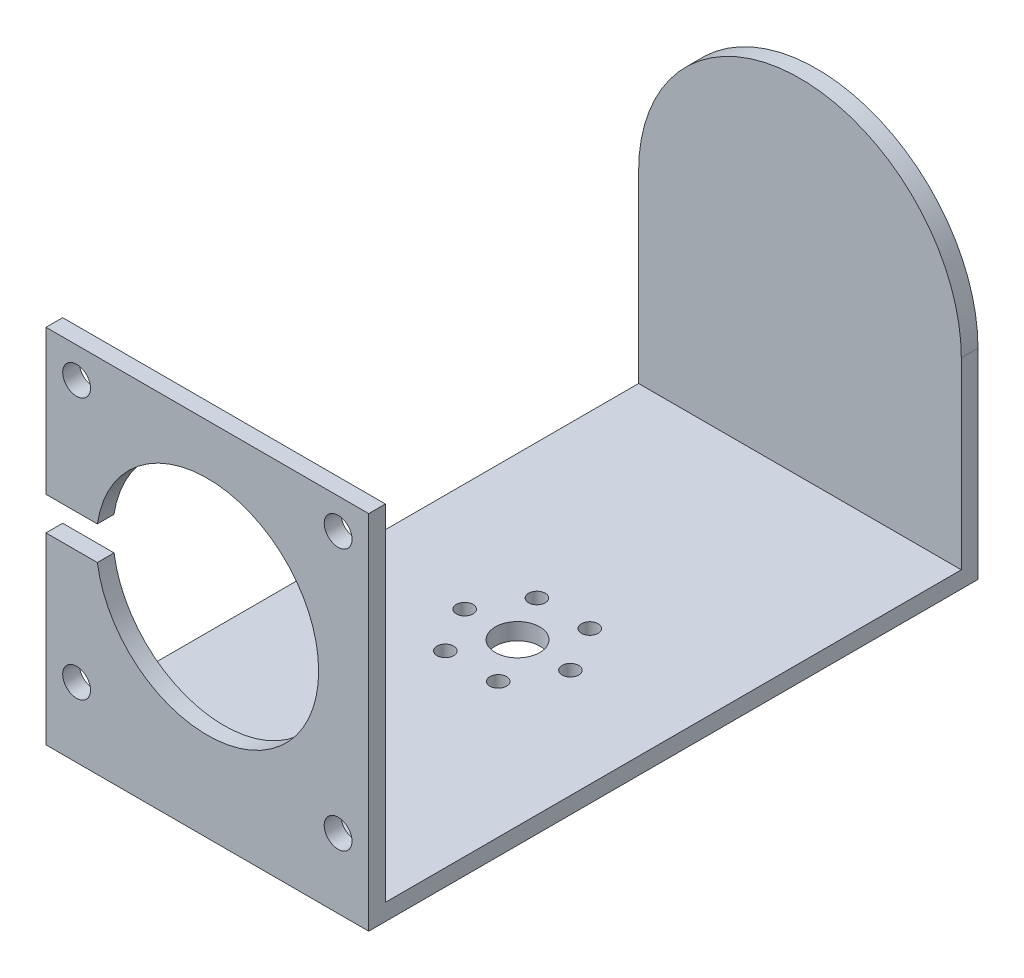
ISO-10303-21;
HEADER;
FILE_DESCRIPTION(('STEP AP214'),'2;1');
FILE_NAME('part.step','',(''),(''),'','','');
FILE_SCHEMA(('AUTOMOTIVE_DESIGN { 1 0 10303 214 1 1 1 1 }'));
ENDSEC;
DATA;
#1=APPLICATION_CONTEXT('core data for automotive mechanical design processes');
#2=APPLICATION_PROTOCOL_DEFINITION('international standard','automotive_design',2000,#1);
#3=PRODUCT_CONTEXT('',#1,'mechanical');
#4=PRODUCT('Part','Part','',(#3));
#5=PRODUCT_RELATED_PRODUCT_CATEGORY('part','',(#4));
#6=PRODUCT_DEFINITION_FORMATION('','',#4);
#7=PRODUCT_DEFINITION_CONTEXT('part definition',#1,'design');
#8=PRODUCT_DEFINITION('design','',#6,#7);
#9=PRODUCT_DEFINITION_SHAPE('','',#8);
#10=(LENGTH_UNIT() NAMED_UNIT(*) SI_UNIT(.MILLI.,.METRE.));
#11=(NAMED_UNIT(*) PLANE_ANGLE_UNIT() SI_UNIT($,.RADIAN.));
#12=(NAMED_UNIT(*) SI_UNIT($,.STERADIAN.) SOLID_ANGLE_UNIT());
#13=UNCERTAINTY_MEASURE_WITH_UNIT(LENGTH_MEASURE(1.E-05),#10,'distance_accuracy_value','');
#14=(GEOMETRIC_REPRESENTATION_CONTEXT(3) GLOBAL_UNCERTAINTY_ASSIGNED_CONTEXT((#13)) GLOBAL_UNIT_ASSIGNED_CONTEXT((#10,
#11,#12)) REPRESENTATION_CONTEXT('',''));
#15=CARTESIAN_POINT('',(0.,0.,0.));
#16=DIRECTION('',(0.,0.,1.));
#17=DIRECTION('',(1.,0.,0.));
#18=AXIS2_PLACEMENT_3D('',#15,#16,#17);
#19=CARTESIAN_POINT('',(0.,0.,0.));
#20=DIRECTION('',(-1.,0.,0.));
#21=DIRECTION('',(0.,0.,1.));
#22=AXIS2_PLACEMENT_3D('',#19,#20,#21);
#23=PLANE('',#22);
#24=DIRECTION('',(0.,0.,1.));
#25=VECTOR('',#24,1.);
#26=CARTESIAN_POINT('',(0.,-31.5991903846266,0.));
#27=LINE('',#26,#25);
#28=CARTESIAN_POINT('',(0.,-31.5991903846266,-30.1483281173427));
#29=VERTEX_POINT('',#28);
#30=CARTESIAN_POINT('',(0.,-31.5991903846266,73.3516718826573));
#31=VERTEX_POINT('',#30);
#32=EDGE_CURVE('E144',#29,#31,#27,.T.);
#33=ORIENTED_EDGE('',*,*,#32,.F.);
#34=DIRECTION('',(0.,-1.,0.));
#35=VECTOR('',#34,1.);
#36=CARTESIAN_POINT('',(0.,-29.5991903846266,-30.1483281173427));
#37=LINE('',#36,#35);
#38=CARTESIAN_POINT('',(0.,1.40080961537345,-30.1483281173427));
#39=VERTEX_POINT('',#38);
#40=EDGE_CURVE('E225',#39,#29,#37,.T.);
#41=ORIENTED_EDGE('',*,*,#40,.F.);
#42=DIRECTION('',(0.,0.,-1.));
#43=VECTOR('',#42,1.);
#44=CARTESIAN_POINT('',(0.,1.40080961537345,24.8516718826573));
#45=LINE('',#44,#43);
#46=CARTESIAN_POINT('',(0.,1.40080961537345,-33.1483281173427));
#47=VERTEX_POINT('',#46);
#48=EDGE_CURVE('E251',#47,#39,#45,.F.);
#49=ORIENTED_EDGE('',*,*,#48,.F.);
#50=DIRECTION('',(0.,1.,0.));
#51=VECTOR('',#50,1.);
#52=CARTESIAN_POINT('',(0.,30.4008096153734,-33.1483281173427));
#53=LINE('',#52,#51);
#54=CARTESIAN_POINT('',(0.,-34.5991903846266,-33.1483281173427));
#55=VERTEX_POINT('',#54);
#56=EDGE_CURVE('E222',#55,#47,#53,.T.);
#57=ORIENTED_EDGE('',*,*,#56,.F.);
#58=DIRECTION('',(0.,0.,-1.));
#59=VECTOR('',#58,1.);
#60=CARTESIAN_POINT('',(0.,-34.5991903846266,-33.1483281173427));
#61=LINE('',#60,#59);
#62=CARTESIAN_POINT('',(0.,-34.5991903846266,76.3516718826573));
#63=VERTEX_POINT('',#62);
#64=EDGE_CURVE('E220',#63,#55,#61,.T.);
#65=ORIENTED_EDGE('',*,*,#64,.F.);
#66=DIRECTION('',(0.,-1.,0.));
#67=VECTOR('',#66,1.);
#68=CARTESIAN_POINT('',(0.,-34.5991903846266,76.3516718826573));
#69=LINE('',#68,#67);
#70=CARTESIAN_POINT('',(0.,-1.59919038462657,76.3516718826573));
#71=VERTEX_POINT('',#70);
#72=EDGE_CURVE('E216',#71,#63,#69,.T.);
#73=ORIENTED_EDGE('',*,*,#72,.F.);
#74=DIRECTION('',(0.,0.,1.));
#75=VECTOR('',#74,1.);
#76=CARTESIAN_POINT('',(0.,-1.59919038462657,66.3516718826573));
#77=LINE('',#76,#75);
#78=CARTESIAN_POINT('',(0.,-1.59919038462657,73.3516718826573));
#79=VERTEX_POINT('',#78);
#80=EDGE_CURVE('E167',#79,#71,#77,.T.);
#81=ORIENTED_EDGE('',*,*,#80,.F.);
#82=DIRECTION('',(0.,1.,0.));
#83=VECTOR('',#82,1.);
#84=CARTESIAN_POINT('',(0.,30.4008096153734,73.3516718826573));
#85=LINE('',#84,#83);
#86=EDGE_CURVE('E205',#31,#79,#85,.T.);
#87=ORIENTED_EDGE('',*,*,#86,.F.);
#88=EDGE_LOOP('',(#33,#41,#49,#57,#65,#73,#81,#87));
#89=FACE_BOUND('',#88,.T.);
#90=ADVANCED_FACE('F33',(#89),#23,.T.);
#91=CARTESIAN_POINT('',(58.,30.4008096153734,-33.1483281173427));
#92=DIRECTION('',(0.,0.,1.));
#93=DIRECTION('',(0.,-1.,0.));
#94=AXIS2_PLACEMENT_3D('',#91,#92,#93);
#95=PLANE('',#94);
#96=ORIENTED_EDGE('',*,*,#56,.T.);
#97=CARTESIAN_POINT('',(29.,1.40080961537345,-33.1483281173427));
#98=DIRECTION('',(0.,0.,1.));
#99=DIRECTION('',(1.,0.,0.));
#100=AXIS2_PLACEMENT_3D('',#97,#98,#99);
#101=CIRCLE('',#100,29.);
#102=CARTESIAN_POINT('',(58.,1.40080961537345,-33.1483281173427));
#103=VERTEX_POINT('',#102);
#104=EDGE_CURVE('E178',#103,#47,#101,.T.);
#105=ORIENTED_EDGE('',*,*,#104,.F.);
#106=DIRECTION('',(0.,1.,0.));
#107=VECTOR('',#106,1.);
#108=CARTESIAN_POINT('',(58.,30.4008096153734,-33.1483281173427));
#109=LINE('',#108,#107);
#110=CARTESIAN_POINT('',(58.,-34.5991903846266,-33.1483281173427));
#111=VERTEX_POINT('',#110);
#112=EDGE_CURVE('E209',#111,#103,#109,.T.);
#113=ORIENTED_EDGE('',*,*,#112,.F.);
#114=DIRECTION('',(-1.,0.,0.));
#115=VECTOR('',#114,1.);
#116=CARTESIAN_POINT('',(58.,-34.5991903846266,-33.1483281173427));
#117=LINE('',#116,#115);
#118=EDGE_CURVE('E230',#111,#55,#117,.T.);
#119=ORIENTED_EDGE('',*,*,#118,.T.);
#120=EDGE_LOOP('',(#96,#105,#113,#119));
#121=FACE_BOUND('',#120,.T.);
#122=CARTESIAN_POINT('',(29.,1.40080961537345,-33.1483281173427));
#123=DIRECTION('',(0.,0.,1.));
#124=DIRECTION('',(0.,-1.,0.));
#125=AXIS2_PLACEMENT_3D('',#122,#123,#124);
#126=CIRCLE('',#125,2.95);
#127=CARTESIAN_POINT('',(29.,-1.54919038462655,-33.1483281173427));
#128=VERTEX_POINT('',#127);
#129=EDGE_CURVE('E254',#128,#128,#126,.F.);
#130=ORIENTED_EDGE('',*,*,#129,.F.);
#131=EDGE_LOOP('',(#130));
#132=FACE_BOUND('',#131,.T.);
#133=ADVANCED_FACE('F296',(#121,#132),#95,.F.);
#134=CARTESIAN_POINT('',(58.,30.4008096153734,76.3516718826573));
#135=DIRECTION('',(0.,-1.,0.));
#136=DIRECTION('',(0.,0.,-1.));
#137=AXIS2_PLACEMENT_3D('',#134,#135,#136);
#138=PLANE('',#137);
#139=DIRECTION('',(0.,0.,1.));
#140=VECTOR('',#139,1.);
#141=CARTESIAN_POINT('',(0.,30.4008096153734,76.3516718826573));
#142=LINE('',#141,#140);
#143=CARTESIAN_POINT('',(0.,30.4008096153734,73.3516718826573));
#144=VERTEX_POINT('',#143);
#145=CARTESIAN_POINT('',(0.,30.4008096153734,76.3516718826573));
#146=VERTEX_POINT('',#145);
#147=EDGE_CURVE('E213',#144,#146,#142,.T.);
#148=ORIENTED_EDGE('',*,*,#147,.T.);
#149=DIRECTION('',(-1.,0.,0.));
#150=VECTOR('',#149,1.);
#151=CARTESIAN_POINT('',(58.,30.4008096153734,76.3516718826573));
#152=LINE('',#151,#150);
#153=CARTESIAN_POINT('',(58.,30.4008096153734,76.3516718826573));
#154=VERTEX_POINT('',#153);
#155=EDGE_CURVE('E236',#154,#146,#152,.T.);
#156=ORIENTED_EDGE('',*,*,#155,.F.);
#157=DIRECTION('',(0.,0.,1.));
#158=VECTOR('',#157,1.);
#159=CARTESIAN_POINT('',(58.,30.4008096153734,76.3516718826573));
#160=LINE('',#159,#158);
#161=CARTESIAN_POINT('',(58.,30.4008096153734,73.3516718826573));
#162=VERTEX_POINT('',#161);
#163=EDGE_CURVE('E202',#162,#154,#160,.T.);
#164=ORIENTED_EDGE('',*,*,#163,.F.);
#165=DIRECTION('',(-1.,0.,0.));
#166=VECTOR('',#165,1.);
#167=CARTESIAN_POINT('',(58.,30.4008096153734,73.3516718826573));
#168=LINE('',#167,#166);
#169=EDGE_CURVE('E129',#162,#144,#168,.T.);
#170=ORIENTED_EDGE('',*,*,#169,.T.);
#171=EDGE_LOOP('',(#148,#156,#164,#170));
#172=FACE_BOUND('',#171,.T.);
#173=ADVANCED_FACE('F35',(#172),#138,.F.);
#174=CARTESIAN_POINT('',(58.,-34.5991903846266,76.3516718826573));
#175=DIRECTION('',(0.,0.,-1.));
#176=DIRECTION('',(0.,1.,0.));
#177=AXIS2_PLACEMENT_3D('',#174,#175,#176);
#178=PLANE('',#177);
#179=CARTESIAN_POINT('',(5.50000000000001,-22.0991903846266,76.3516718826573));
#180=DIRECTION('',(0.,0.,1.));
#181=DIRECTION('',(-1.,0.,0.));
#182=AXIS2_PLACEMENT_3D('',#179,#180,#181);
#183=CIRCLE('',#182,2.5);
#184=CARTESIAN_POINT('',(3.00000000000001,-22.0991903846266,76.3516718826573));
#185=VERTEX_POINT('',#184);
#186=EDGE_CURVE('E186',#185,#185,#183,.T.);
#187=ORIENTED_EDGE('',*,*,#186,.F.);
#188=EDGE_LOOP('',(#187));
#189=FACE_BOUND('',#188,.T.);
#190=CARTESIAN_POINT('',(52.5,-22.0991903846266,76.3516718826573));
#191=DIRECTION('',(0.,0.,1.));
#192=DIRECTION('',(1.,0.,0.));
#193=AXIS2_PLACEMENT_3D('',#190,#191,#192);
#194=CIRCLE('',#193,2.5);
#195=CARTESIAN_POINT('',(55.,-22.0991903846266,76.3516718826573));
#196=VERTEX_POINT('',#195);
#197=EDGE_CURVE('E190',#196,#196,#194,.T.);
#198=ORIENTED_EDGE('',*,*,#197,.F.);
#199=EDGE_LOOP('',(#198));
#200=FACE_BOUND('',#199,.T.);
#201=CARTESIAN_POINT('',(52.5,24.9008096153734,76.3516718826573));
#202=DIRECTION('',(0.,0.,1.));
#203=DIRECTION('',(-1.,0.,0.));
#204=AXIS2_PLACEMENT_3D('',#201,#202,#203);
#205=CIRCLE('',#204,2.5);
#206=CARTESIAN_POINT('',(50.,24.9008096153734,76.3516718826573));
#207=VERTEX_POINT('',#206);
#208=EDGE_CURVE('E194',#207,#207,#205,.T.);
#209=ORIENTED_EDGE('',*,*,#208,.F.);
#210=EDGE_LOOP('',(#209));
#211=FACE_BOUND('',#210,.T.);
#212=CARTESIAN_POINT('',(5.5,24.9008096153734,76.3516718826573));
#213=DIRECTION('',(0.,0.,1.));
#214=DIRECTION('',(1.,0.,0.));
#215=AXIS2_PLACEMENT_3D('',#212,#213,#214);
#216=CIRCLE('',#215,2.5);
#217=CARTESIAN_POINT('',(8.,24.9008096153734,76.3516718826573));
#218=VERTEX_POINT('',#217);
#219=EDGE_CURVE('E198',#218,#218,#216,.T.);
#220=ORIENTED_EDGE('',*,*,#219,.F.);
#221=EDGE_LOOP('',(#220));
#222=FACE_BOUND('',#221,.T.);
#223=CARTESIAN_POINT('',(29.,1.40080961537344,76.3516718826573));
#224=DIRECTION('',(0.,0.,1.));
#225=DIRECTION('',(1.,0.,0.));
#226=AXIS2_PLACEMENT_3D('',#223,#224,#225);
#227=CIRCLE('',#226,20.);
#228=CARTESIAN_POINT('',(9.22628006671482,-1.59919038462657,76.3516718826573));
#229=VERTEX_POINT('',#228);
#230=CARTESIAN_POINT('',(9.22628006671482,4.40080961537343,76.3516718826573));
#231=VERTEX_POINT('',#230);
#232=EDGE_CURVE('E182',#229,#231,#227,.T.);
#233=ORIENTED_EDGE('',*,*,#232,.F.);
#234=DIRECTION('',(1.,0.,0.));
#235=VECTOR('',#234,1.);
#236=CARTESIAN_POINT('',(29.,-1.59919038462656,76.3516718826573));
#237=LINE('',#236,#235);
#238=EDGE_CURVE('E57',#71,#229,#237,.T.);
#239=ORIENTED_EDGE('',*,*,#238,.F.);
#240=ORIENTED_EDGE('',*,*,#72,.T.);
#241=DIRECTION('',(-1.,0.,0.));
#242=VECTOR('',#241,1.);
#243=CARTESIAN_POINT('',(58.,-34.5991903846266,76.3516718826573));
#244=LINE('',#243,#242);
#245=CARTESIAN_POINT('',(58.,-34.5991903846266,76.3516718826573));
#246=VERTEX_POINT('',#245);
#247=EDGE_CURVE('E233',#246,#63,#244,.T.);
#248=ORIENTED_EDGE('',*,*,#247,.F.);
#249=DIRECTION('',(0.,-1.,0.));
#250=VECTOR('',#249,1.);
#251=CARTESIAN_POINT('',(58.,-34.5991903846266,76.3516718826573));
#252=LINE('',#251,#250);
#253=EDGE_CURVE('E204',#154,#246,#252,.T.);
#254=ORIENTED_EDGE('',*,*,#253,.F.);
#255=ORIENTED_EDGE('',*,*,#155,.T.);
#256=CARTESIAN_POINT('',(0.,4.40080961537343,76.3516718826573));
#257=VERTEX_POINT('',#256);
#258=EDGE_CURVE('E217',#146,#257,#69,.T.);
#259=ORIENTED_EDGE('',*,*,#258,.T.);
#260=DIRECTION('',(-1.,0.,0.));
#261=VECTOR('',#260,1.);
#262=CARTESIAN_POINT('',(29.,4.40080961537344,76.3516718826573));
#263=LINE('',#262,#261);
#264=EDGE_CURVE('E163',#231,#257,#263,.T.);
#265=ORIENTED_EDGE('',*,*,#264,.F.);
#266=EDGE_LOOP('',(#233,#239,#240,#248,#254,#255,#259,#265));
#267=FACE_BOUND('',#266,.T.);
#268=ADVANCED_FACE('F271',(#189,#200,#211,#222,#267),#178,.F.);
#269=CARTESIAN_POINT('',(58.,-34.5991903846266,-33.1483281173427));
#270=DIRECTION('',(0.,1.,0.));
#271=DIRECTION('',(0.,0.,1.));
#272=AXIS2_PLACEMENT_3D('',#269,#270,#271);
#273=PLANE('',#272);
#274=CARTESIAN_POINT('',(24.2499999999999,-34.5991903846266,28.8289132186094));
#275=DIRECTION('',(0.,1.,0.));
#276=DIRECTION('',(0.,0.,1.));
#277=AXIS2_PLACEMENT_3D('',#274,#275,#276);
#278=CIRCLE('',#277,1.50000000000001);
#279=CARTESIAN_POINT('',(24.2499999999999,-34.5991903846266,30.3289132186094));
#280=VERTEX_POINT('',#279);
#281=EDGE_CURVE('E506',#280,#280,#278,.T.);
#282=ORIENTED_EDGE('',*,*,#281,.T.);
#283=EDGE_LOOP('',(#282));
#284=FACE_BOUND('',#283,.T.);
#285=CARTESIAN_POINT('',(33.7499999999999,-34.5991903846266,28.8289132186095));
#286=DIRECTION('',(0.,1.,0.));
#287=DIRECTION('',(0.,0.,1.));
#288=AXIS2_PLACEMENT_3D('',#285,#286,#287);
#289=CIRCLE('',#288,1.5);
#290=CARTESIAN_POINT('',(33.7499999999999,-34.5991903846266,30.3289132186095));
#291=VERTEX_POINT('',#290);
#292=EDGE_CURVE('E510',#291,#291,#289,.T.);
#293=ORIENTED_EDGE('',*,*,#292,.T.);
#294=EDGE_LOOP('',(#293));
#295=FACE_BOUND('',#294,.T.);
#296=CARTESIAN_POINT('',(38.5,-34.5991903846266,20.6016718826573));
#297=DIRECTION('',(0.,1.,0.));
#298=DIRECTION('',(0.,0.,1.));
#299=AXIS2_PLACEMENT_3D('',#296,#297,#298);
#300=CIRCLE('',#299,1.49999999999999);
#301=CARTESIAN_POINT('',(38.5,-34.5991903846266,22.1016718826573));
#302=VERTEX_POINT('',#301);
#303=EDGE_CURVE('E519',#302,#302,#300,.T.);
#304=ORIENTED_EDGE('',*,*,#303,.T.);
#305=EDGE_LOOP('',(#304));
#306=FACE_BOUND('',#305,.T.);
#307=CARTESIAN_POINT('',(33.7500000000001,-34.5991903846266,12.3744305467051));
#308=DIRECTION('',(0.,1.,0.));
#309=DIRECTION('',(0.,0.,1.));
#310=AXIS2_PLACEMENT_3D('',#307,#308,#309);
#311=CIRCLE('',#310,1.5);
#312=CARTESIAN_POINT('',(33.7500000000001,-34.5991903846266,13.8744305467051));
#313=VERTEX_POINT('',#312);
#314=EDGE_CURVE('E525',#313,#313,#311,.T.);
#315=ORIENTED_EDGE('',*,*,#314,.T.);
#316=EDGE_LOOP('',(#315));
#317=FACE_BOUND('',#316,.T.);
#318=CARTESIAN_POINT('',(24.25,-34.5991903846266,12.3744305467051));
#319=DIRECTION('',(0.,1.,0.));
#320=DIRECTION('',(0.,0.,1.));
#321=AXIS2_PLACEMENT_3D('',#318,#319,#320);
#322=CIRCLE('',#321,1.5);
#323=CARTESIAN_POINT('',(24.25,-34.5991903846266,13.8744305467051));
#324=VERTEX_POINT('',#323);
#325=EDGE_CURVE('E531',#324,#324,#322,.T.);
#326=ORIENTED_EDGE('',*,*,#325,.T.);
#327=EDGE_LOOP('',(#326));
#328=FACE_BOUND('',#327,.T.);
#329=CARTESIAN_POINT('',(19.5,-34.5991903846266,20.6016718826573));
#330=DIRECTION('',(0.,1.,0.));
#331=DIRECTION('',(0.,0.,1.));
#332=AXIS2_PLACEMENT_3D('',#329,#330,#331);
#333=CIRCLE('',#332,1.5);
#334=CARTESIAN_POINT('',(19.5,-34.5991903846266,22.1016718826573));
#335=VERTEX_POINT('',#334);
#336=EDGE_CURVE('E151',#335,#335,#333,.T.);
#337=ORIENTED_EDGE('',*,*,#336,.T.);
#338=EDGE_LOOP('',(#337));
#339=FACE_BOUND('',#338,.T.);
#340=CARTESIAN_POINT('',(29.,-34.5991903846266,20.6016718826573));
#341=DIRECTION('',(0.,-1.,0.));
#342=DIRECTION('',(0.,0.,-1.));
#343=AXIS2_PLACEMENT_3D('',#340,#341,#342);
#344=CIRCLE('',#343,4.);
#345=CARTESIAN_POINT('',(29.,-34.5991903846266,16.6016718826573));
#346=VERTEX_POINT('',#345);
#347=EDGE_CURVE('E160',#346,#346,#344,.T.);
#348=ORIENTED_EDGE('',*,*,#347,.F.);
#349=EDGE_LOOP('',(#348));
#350=FACE_BOUND('',#349,.T.);
#351=ORIENTED_EDGE('',*,*,#64,.T.);
#352=ORIENTED_EDGE('',*,*,#118,.F.);
#353=DIRECTION('',(0.,0.,-1.));
#354=VECTOR('',#353,1.);
#355=CARTESIAN_POINT('',(58.,-34.5991903846266,-33.1483281173427));
#356=LINE('',#355,#354);
#357=EDGE_CURVE('E207',#246,#111,#356,.T.);
#358=ORIENTED_EDGE('',*,*,#357,.F.);
#359=ORIENTED_EDGE('',*,*,#247,.T.);
#360=EDGE_LOOP('',(#351,#352,#358,#359));
#361=FACE_BOUND('',#360,.T.);
#362=ADVANCED_FACE('F274',(#284,#295,#306,#317,#328,#339,#350,#361),#273,.F.);
#363=CARTESIAN_POINT('',(58.,-29.5991903846266,-30.1483281173427));
#364=DIRECTION('',(0.,0.,-1.));
#365=DIRECTION('',(-1.,0.,0.));
#366=AXIS2_PLACEMENT_3D('',#363,#364,#365);
#367=PLANE('',#366);
#368=CARTESIAN_POINT('',(29.,1.40080961537345,-30.1483281173427));
#369=DIRECTION('',(0.,0.,-1.));
#370=DIRECTION('',(-1.,0.,0.));
#371=AXIS2_PLACEMENT_3D('',#368,#369,#370);
#372=CIRCLE('',#371,29.);
#373=CARTESIAN_POINT('',(58.,1.40080961537345,-30.1483281173427));
#374=VERTEX_POINT('',#373);
#375=EDGE_CURVE('E180',#374,#39,#372,.F.);
#376=ORIENTED_EDGE('',*,*,#375,.T.);
#377=ORIENTED_EDGE('',*,*,#40,.T.);
#378=DIRECTION('',(1.,0.,0.));
#379=VECTOR('',#378,1.);
#380=CARTESIAN_POINT('',(-32.,-31.5991903846266,-30.1483281173427));
#381=LINE('',#380,#379);
#382=CARTESIAN_POINT('',(58.,-31.5991903846266,-30.1483281173427));
#383=VERTEX_POINT('',#382);
#384=EDGE_CURVE('E145',#29,#383,#381,.T.);
#385=ORIENTED_EDGE('',*,*,#384,.T.);
#386=DIRECTION('',(0.,-1.,0.));
#387=VECTOR('',#386,1.);
#388=CARTESIAN_POINT('',(58.,-29.5991903846266,-30.1483281173427));
#389=LINE('',#388,#387);
#390=EDGE_CURVE('E134',#374,#383,#389,.T.);
#391=ORIENTED_EDGE('',*,*,#390,.F.);
#392=EDGE_LOOP('',(#376,#377,#385,#391));
#393=FACE_BOUND('',#392,.T.);
#394=ADVANCED_FACE('F317',(#393),#367,.F.);
#395=CARTESIAN_POINT('',(58.,30.4008096153734,73.3516718826573));
#396=DIRECTION('',(0.,0.,1.));
#397=DIRECTION('',(0.,-1.,0.));
#398=AXIS2_PLACEMENT_3D('',#395,#396,#397);
#399=PLANE('',#398);
#400=ORIENTED_EDGE('',*,*,#86,.T.);
#401=DIRECTION('',(1.,0.,0.));
#402=VECTOR('',#401,1.);
#403=CARTESIAN_POINT('',(58.,-1.59919038462655,73.3516718826573));
#404=LINE('',#403,#402);
#405=CARTESIAN_POINT('',(9.22628006671482,-1.59919038462657,73.3516718826573));
#406=VERTEX_POINT('',#405);
#407=EDGE_CURVE('E172',#79,#406,#404,.T.);
#408=ORIENTED_EDGE('',*,*,#407,.T.);
#409=CARTESIAN_POINT('',(29.,1.40080961537344,73.3516718826573));
#410=DIRECTION('',(0.,0.,1.));
#411=DIRECTION('',(0.,-1.,0.));
#412=AXIS2_PLACEMENT_3D('',#409,#410,#411);
#413=CIRCLE('',#412,20.);
#414=CARTESIAN_POINT('',(9.22628006671482,4.40080961537343,73.3516718826573));
#415=VERTEX_POINT('',#414);
#416=EDGE_CURVE('E185',#406,#415,#413,.T.);
#417=ORIENTED_EDGE('',*,*,#416,.T.);
#418=DIRECTION('',(-1.,0.,0.));
#419=VECTOR('',#418,1.);
#420=CARTESIAN_POINT('',(58.,4.40080961537344,73.3516718826573));
#421=LINE('',#420,#419);
#422=CARTESIAN_POINT('',(0.,4.40080961537343,73.3516718826573));
#423=VERTEX_POINT('',#422);
#424=EDGE_CURVE('E49',#415,#423,#421,.T.);
#425=ORIENTED_EDGE('',*,*,#424,.T.);
#426=EDGE_CURVE('E227',#423,#144,#85,.T.);
#427=ORIENTED_EDGE('',*,*,#426,.T.);
#428=ORIENTED_EDGE('',*,*,#169,.F.);
#429=DIRECTION('',(0.,1.,0.));
#430=VECTOR('',#429,1.);
#431=CARTESIAN_POINT('',(58.,30.4008096153734,73.3516718826573));
#432=LINE('',#431,#430);
#433=CARTESIAN_POINT('',(58.,-31.5991903846266,73.3516718826573));
#434=VERTEX_POINT('',#433);
#435=EDGE_CURVE('E122',#434,#162,#432,.T.);
#436=ORIENTED_EDGE('',*,*,#435,.F.);
#437=DIRECTION('',(1.,0.,0.));
#438=VECTOR('',#437,1.);
#439=CARTESIAN_POINT('',(-32.,-31.5991903846266,73.3516718826573));
#440=LINE('',#439,#438);
#441=EDGE_CURVE('E127',#31,#434,#440,.T.);
#442=ORIENTED_EDGE('',*,*,#441,.F.);
#443=EDGE_LOOP('',(#400,#408,#417,#425,#427,#428,#436,#442));
#444=FACE_BOUND('',#443,.T.);
#445=CARTESIAN_POINT('',(5.50000000000001,-22.0991903846266,73.3516718826573));
#446=DIRECTION('',(0.,0.,1.));
#447=DIRECTION('',(0.,-1.,0.));
#448=AXIS2_PLACEMENT_3D('',#445,#446,#447);
#449=CIRCLE('',#448,2.5);
#450=CARTESIAN_POINT('',(5.50000000000001,-24.5991903846266,73.3516718826573));
#451=VERTEX_POINT('',#450);
#452=EDGE_CURVE('E189',#451,#451,#449,.T.);
#453=ORIENTED_EDGE('',*,*,#452,.T.);
#454=EDGE_LOOP('',(#453));
#455=FACE_BOUND('',#454,.T.);
#456=CARTESIAN_POINT('',(52.5,-22.0991903846266,73.3516718826573));
#457=DIRECTION('',(0.,0.,1.));
#458=DIRECTION('',(0.,-1.,0.));
#459=AXIS2_PLACEMENT_3D('',#456,#457,#458);
#460=CIRCLE('',#459,2.5);
#461=CARTESIAN_POINT('',(52.5,-24.5991903846266,73.3516718826573));
#462=VERTEX_POINT('',#461);
#463=EDGE_CURVE('E193',#462,#462,#460,.T.);
#464=ORIENTED_EDGE('',*,*,#463,.T.);
#465=EDGE_LOOP('',(#464));
#466=FACE_BOUND('',#465,.T.);
#467=CARTESIAN_POINT('',(52.5,24.9008096153734,73.3516718826573));
#468=DIRECTION('',(0.,0.,1.));
#469=DIRECTION('',(0.,-1.,0.));
#470=AXIS2_PLACEMENT_3D('',#467,#468,#469);
#471=CIRCLE('',#470,2.5);
#472=CARTESIAN_POINT('',(52.5,22.4008096153734,73.3516718826573));
#473=VERTEX_POINT('',#472);
#474=EDGE_CURVE('E197',#473,#473,#471,.T.);
#475=ORIENTED_EDGE('',*,*,#474,.T.);
#476=EDGE_LOOP('',(#475));
#477=FACE_BOUND('',#476,.T.);
#478=CARTESIAN_POINT('',(5.5,24.9008096153734,73.3516718826573));
#479=DIRECTION('',(0.,0.,1.));
#480=DIRECTION('',(0.,-1.,0.));
#481=AXIS2_PLACEMENT_3D('',#478,#479,#480);
#482=CIRCLE('',#481,2.5);
#483=CARTESIAN_POINT('',(5.5,22.4008096153734,73.3516718826573));
#484=VERTEX_POINT('',#483);
#485=EDGE_CURVE('E201',#484,#484,#482,.T.);
#486=ORIENTED_EDGE('',*,*,#485,.T.);
#487=EDGE_LOOP('',(#486));
#488=FACE_BOUND('',#487,.T.);
#489=ADVANCED_FACE('F125',(#444,#455,#466,#477,#488),#399,.F.);
#490=CARTESIAN_POINT('',(58.,0.,0.));
#491=DIRECTION('',(-1.,0.,0.));
#492=DIRECTION('',(0.,0.,1.));
#493=AXIS2_PLACEMENT_3D('',#490,#491,#492);
#494=PLANE('',#493);
#495=ORIENTED_EDGE('',*,*,#390,.T.);
#496=DIRECTION('',(0.,0.,-1.));
#497=VECTOR('',#496,1.);
#498=CARTESIAN_POINT('',(58.,-31.5991903846266,73.3516718826573));
#499=LINE('',#498,#497);
#500=EDGE_CURVE('E142',#434,#383,#499,.T.);
#501=ORIENTED_EDGE('',*,*,#500,.F.);
#502=ORIENTED_EDGE('',*,*,#435,.T.);
#503=ORIENTED_EDGE('',*,*,#163,.T.);
#504=ORIENTED_EDGE('',*,*,#253,.T.);
#505=ORIENTED_EDGE('',*,*,#357,.T.);
#506=ORIENTED_EDGE('',*,*,#112,.T.);
#507=DIRECTION('',(0.,0.,-1.));
#508=VECTOR('',#507,1.);
#509=CARTESIAN_POINT('',(58.,1.40080961537345,24.8516718826573));
#510=LINE('',#509,#508);
#511=EDGE_CURVE('E239',#103,#374,#510,.F.);
#512=ORIENTED_EDGE('',*,*,#511,.T.);
#513=EDGE_LOOP('',(#495,#501,#502,#503,#504,#505,#506,#512));
#514=FACE_BOUND('',#513,.T.);
#515=ADVANCED_FACE('F147',(#514),#494,.F.);
#516=DIRECTION('',(0.,0.,1.));
#517=VECTOR('',#516,1.);
#518=CARTESIAN_POINT('',(0.,4.40080961537343,66.3516718826573));
#519=LINE('',#518,#517);
#520=EDGE_CURVE('E166',#423,#257,#519,.T.);
#521=ORIENTED_EDGE('',*,*,#520,.T.);
#522=ORIENTED_EDGE('',*,*,#258,.F.);
#523=ORIENTED_EDGE('',*,*,#147,.F.);
#524=ORIENTED_EDGE('',*,*,#426,.F.);
#525=EDGE_LOOP('',(#521,#522,#523,#524));
#526=FACE_BOUND('',#525,.T.);
#527=ADVANCED_FACE('F281',(#526),#23,.T.);
#528=CARTESIAN_POINT('',(5.5,24.9008096153734,18.3516718826573));
#529=DIRECTION('',(0.,0.,1.));
#530=DIRECTION('',(1.,0.,0.));
#531=AXIS2_PLACEMENT_3D('',#528,#529,#530);
#532=CYLINDRICAL_SURFACE('',#531,2.5);
#533=ORIENTED_EDGE('',*,*,#219,.T.);
#534=EDGE_LOOP('',(#533));
#535=FACE_BOUND('',#534,.T.);
#536=ORIENTED_EDGE('',*,*,#485,.F.);
#537=EDGE_LOOP('',(#536));
#538=FACE_BOUND('',#537,.T.);
#539=ADVANCED_FACE('F306',(#535,#538),#532,.F.);
#540=CARTESIAN_POINT('',(52.5,24.9008096153734,18.3516718826573));
#541=DIRECTION('',(0.,0.,1.));
#542=DIRECTION('',(1.,0.,0.));
#543=AXIS2_PLACEMENT_3D('',#540,#541,#542);
#544=CYLINDRICAL_SURFACE('',#543,2.5);
#545=ORIENTED_EDGE('',*,*,#208,.T.);
#546=EDGE_LOOP('',(#545));
#547=FACE_BOUND('',#546,.T.);
#548=ORIENTED_EDGE('',*,*,#474,.F.);
#549=EDGE_LOOP('',(#548));
#550=FACE_BOUND('',#549,.T.);
#551=ADVANCED_FACE('F311',(#547,#550),#544,.F.);
#552=CARTESIAN_POINT('',(52.5,-22.0991903846266,18.3516718826573));
#553=DIRECTION('',(0.,0.,1.));
#554=DIRECTION('',(1.,0.,0.));
#555=AXIS2_PLACEMENT_3D('',#552,#553,#554);
#556=CYLINDRICAL_SURFACE('',#555,2.5);
#557=ORIENTED_EDGE('',*,*,#197,.T.);
#558=EDGE_LOOP('',(#557));
#559=FACE_BOUND('',#558,.T.);
#560=ORIENTED_EDGE('',*,*,#463,.F.);
#561=EDGE_LOOP('',(#560));
#562=FACE_BOUND('',#561,.T.);
#563=ADVANCED_FACE('F321',(#559,#562),#556,.F.);
#564=CARTESIAN_POINT('',(5.50000000000001,-22.0991903846266,18.3516718826573));
#565=DIRECTION('',(0.,0.,1.));
#566=DIRECTION('',(1.,0.,0.));
#567=AXIS2_PLACEMENT_3D('',#564,#565,#566);
#568=CYLINDRICAL_SURFACE('',#567,2.5);
#569=ORIENTED_EDGE('',*,*,#186,.T.);
#570=EDGE_LOOP('',(#569));
#571=FACE_BOUND('',#570,.T.);
#572=ORIENTED_EDGE('',*,*,#452,.F.);
#573=EDGE_LOOP('',(#572));
#574=FACE_BOUND('',#573,.T.);
#575=ADVANCED_FACE('F325',(#571,#574),#568,.F.);
#576=CARTESIAN_POINT('',(29.,1.40080961537344,18.3516718826573));
#577=DIRECTION('',(0.,0.,1.));
#578=DIRECTION('',(1.,0.,0.));
#579=AXIS2_PLACEMENT_3D('',#576,#577,#578);
#580=CYLINDRICAL_SURFACE('',#579,20.);
#581=ORIENTED_EDGE('',*,*,#416,.F.);
#582=DIRECTION('',(0.,0.,1.));
#583=VECTOR('',#582,1.);
#584=CARTESIAN_POINT('',(9.22628006671482,-1.59919038462657,18.3516718826573));
#585=LINE('',#584,#583);
#586=EDGE_CURVE('E11',#406,#229,#585,.T.);
#587=ORIENTED_EDGE('',*,*,#586,.T.);
#588=ORIENTED_EDGE('',*,*,#232,.T.);
#589=DIRECTION('',(0.,0.,1.));
#590=VECTOR('',#589,1.);
#591=CARTESIAN_POINT('',(9.22628006671482,4.40080961537343,18.3516718826573));
#592=LINE('',#591,#590);
#593=EDGE_CURVE('E42',#231,#415,#592,.F.);
#594=ORIENTED_EDGE('',*,*,#593,.T.);
#595=EDGE_LOOP('',(#581,#587,#588,#594));
#596=FACE_BOUND('',#595,.T.);
#597=ADVANCED_FACE('F259',(#596),#580,.F.);
#598=CARTESIAN_POINT('',(29.,1.40080961537345,24.8516718826573));
#599=DIRECTION('',(0.,0.,-1.));
#600=DIRECTION('',(-1.,0.,0.));
#601=AXIS2_PLACEMENT_3D('',#598,#599,#600);
#602=CYLINDRICAL_SURFACE('',#601,29.);
#603=ORIENTED_EDGE('',*,*,#511,.F.);
#604=ORIENTED_EDGE('',*,*,#104,.T.);
#605=ORIENTED_EDGE('',*,*,#48,.T.);
#606=ORIENTED_EDGE('',*,*,#375,.F.);
#607=EDGE_LOOP('',(#603,#604,#605,#606));
#608=FACE_BOUND('',#607,.T.);
#609=ADVANCED_FACE('F332',(#608),#602,.T.);
#610=CARTESIAN_POINT('',(29.,1.40080961537345,-41.1483281173427));
#611=DIRECTION('',(0.,0.,1.));
#612=DIRECTION('',(1.,0.,0.));
#613=AXIS2_PLACEMENT_3D('',#610,#611,#612);
#614=CYLINDRICAL_SURFACE('',#613,2.95);
#615=CARTESIAN_POINT('',(29.,1.40080961537345,-41.1483281173427));
#616=DIRECTION('',(0.,0.,-1.));
#617=DIRECTION('',(-1.,0.,0.));
#618=AXIS2_PLACEMENT_3D('',#615,#616,#617);
#619=CIRCLE('',#618,2.95);
#620=CARTESIAN_POINT('',(26.05,1.40080961537345,-41.1483281173427));
#621=VERTEX_POINT('',#620);
#622=EDGE_CURVE('E175',#621,#621,#619,.T.);
#623=ORIENTED_EDGE('',*,*,#622,.F.);
#624=EDGE_LOOP('',(#623));
#625=FACE_BOUND('',#624,.T.);
#626=ORIENTED_EDGE('',*,*,#129,.T.);
#627=EDGE_LOOP('',(#626));
#628=FACE_BOUND('',#627,.T.);
#629=ADVANCED_FACE('F292',(#625,#628),#614,.T.);
#630=CARTESIAN_POINT('',(29.,1.40080961537345,-41.1483281173427));
#631=DIRECTION('',(0.,0.,-1.));
#632=DIRECTION('',(-1.,0.,0.));
#633=AXIS2_PLACEMENT_3D('',#630,#631,#632);
#634=PLANE('',#633);
#635=ORIENTED_EDGE('',*,*,#622,.T.);
#636=EDGE_LOOP('',(#635));
#637=FACE_BOUND('',#636,.T.);
#638=ADVANCED_FACE('F284',(#637),#634,.T.);
#639=CARTESIAN_POINT('',(29.,4.40080961537344,66.3516718826573));
#640=DIRECTION('',(0.,1.,0.));
#641=DIRECTION('',(-1.,0.,0.));
#642=AXIS2_PLACEMENT_3D('',#639,#640,#641);
#643=PLANE('',#642);
#644=ORIENTED_EDGE('',*,*,#593,.F.);
#645=ORIENTED_EDGE('',*,*,#264,.T.);
#646=ORIENTED_EDGE('',*,*,#520,.F.);
#647=ORIENTED_EDGE('',*,*,#424,.F.);
#648=EDGE_LOOP('',(#644,#645,#646,#647));
#649=FACE_BOUND('',#648,.T.);
#650=ADVANCED_FACE('F282',(#649),#643,.F.);
#651=CARTESIAN_POINT('',(29.,-1.59919038462656,66.3516718826573));
#652=DIRECTION('',(0.,-1.,0.));
#653=DIRECTION('',(1.,0.,0.));
#654=AXIS2_PLACEMENT_3D('',#651,#652,#653);
#655=PLANE('',#654);
#656=ORIENTED_EDGE('',*,*,#80,.T.);
#657=ORIENTED_EDGE('',*,*,#238,.T.);
#658=ORIENTED_EDGE('',*,*,#586,.F.);
#659=ORIENTED_EDGE('',*,*,#407,.F.);
#660=EDGE_LOOP('',(#656,#657,#658,#659));
#661=FACE_BOUND('',#660,.T.);
#662=ADVANCED_FACE('F264',(#661),#655,.F.);
#663=CARTESIAN_POINT('',(29.,-24.5991903846266,20.6016718826573));
#664=DIRECTION('',(0.,-1.,0.));
#665=DIRECTION('',(0.,0.,-1.));
#666=AXIS2_PLACEMENT_3D('',#663,#664,#665);
#667=CYLINDRICAL_SURFACE('',#666,4.);
#668=CARTESIAN_POINT('',(29.,-31.5991903846266,20.6016718826573));
#669=DIRECTION('',(0.,-1.,0.));
#670=DIRECTION('',(0.,0.,-1.));
#671=AXIS2_PLACEMENT_3D('',#668,#669,#670);
#672=CIRCLE('',#671,4.);
#673=CARTESIAN_POINT('',(29.,-31.5991903846266,16.6016718826573));
#674=VERTEX_POINT('',#673);
#675=EDGE_CURVE('E37',#674,#674,#672,.F.);
#676=ORIENTED_EDGE('',*,*,#675,.T.);
#677=EDGE_LOOP('',(#676));
#678=FACE_BOUND('',#677,.T.);
#679=ORIENTED_EDGE('',*,*,#347,.T.);
#680=EDGE_LOOP('',(#679));
#681=FACE_BOUND('',#680,.T.);
#682=ADVANCED_FACE('F290',(#678,#681),#667,.F.);
#683=CARTESIAN_POINT('',(-32.,-31.5991903846266,73.3516718826573));
#684=DIRECTION('',(0.,-1.,0.));
#685=DIRECTION('',(0.,0.,-1.));
#686=AXIS2_PLACEMENT_3D('',#683,#684,#685);
#687=PLANE('',#686);
#688=CARTESIAN_POINT('',(24.2499999999999,-31.5991903846266,28.8289132186094));
#689=DIRECTION('',(0.,1.,0.));
#690=DIRECTION('',(0.,0.,1.));
#691=AXIS2_PLACEMENT_3D('',#688,#689,#690);
#692=CIRCLE('',#691,1.50000000000001);
#693=CARTESIAN_POINT('',(24.2499999999999,-31.5991903846266,30.3289132186094));
#694=VERTEX_POINT('',#693);
#695=EDGE_CURVE('E503',#694,#694,#692,.T.);
#696=ORIENTED_EDGE('',*,*,#695,.F.);
#697=EDGE_LOOP('',(#696));
#698=FACE_BOUND('',#697,.T.);
#699=CARTESIAN_POINT('',(33.7499999999999,-31.5991903846266,28.8289132186095));
#700=DIRECTION('',(0.,1.,0.));
#701=DIRECTION('',(0.,0.,1.));
#702=AXIS2_PLACEMENT_3D('',#699,#700,#701);
#703=CIRCLE('',#702,1.5);
#704=CARTESIAN_POINT('',(33.7499999999999,-31.5991903846266,30.3289132186095));
#705=VERTEX_POINT('',#704);
#706=EDGE_CURVE('E507',#705,#705,#703,.T.);
#707=ORIENTED_EDGE('',*,*,#706,.F.);
#708=EDGE_LOOP('',(#707));
#709=FACE_BOUND('',#708,.T.);
#710=CARTESIAN_POINT('',(38.5,-31.5991903846266,20.6016718826573));
#711=DIRECTION('',(0.,1.,0.));
#712=DIRECTION('',(0.,0.,1.));
#713=AXIS2_PLACEMENT_3D('',#710,#711,#712);
#714=CIRCLE('',#713,1.49999999999999);
#715=CARTESIAN_POINT('',(38.5,-31.5991903846266,22.1016718826573));
#716=VERTEX_POINT('',#715);
#717=EDGE_CURVE('E516',#716,#716,#714,.T.);
#718=ORIENTED_EDGE('',*,*,#717,.F.);
#719=EDGE_LOOP('',(#718));
#720=FACE_BOUND('',#719,.T.);
#721=CARTESIAN_POINT('',(33.7500000000001,-31.5991903846266,12.3744305467051));
#722=DIRECTION('',(0.,1.,0.));
#723=DIRECTION('',(0.,0.,1.));
#724=AXIS2_PLACEMENT_3D('',#721,#722,#723);
#725=CIRCLE('',#724,1.5);
#726=CARTESIAN_POINT('',(33.7500000000001,-31.5991903846266,13.8744305467051));
#727=VERTEX_POINT('',#726);
#728=EDGE_CURVE('E522',#727,#727,#725,.T.);
#729=ORIENTED_EDGE('',*,*,#728,.F.);
#730=EDGE_LOOP('',(#729));
#731=FACE_BOUND('',#730,.T.);
#732=CARTESIAN_POINT('',(24.25,-31.5991903846266,12.3744305467051));
#733=DIRECTION('',(0.,1.,0.));
#734=DIRECTION('',(0.,0.,1.));
#735=AXIS2_PLACEMENT_3D('',#732,#733,#734);
#736=CIRCLE('',#735,1.5);
#737=CARTESIAN_POINT('',(24.25,-31.5991903846266,13.8744305467051));
#738=VERTEX_POINT('',#737);
#739=EDGE_CURVE('E528',#738,#738,#736,.T.);
#740=ORIENTED_EDGE('',*,*,#739,.F.);
#741=EDGE_LOOP('',(#740));
#742=FACE_BOUND('',#741,.T.);
#743=CARTESIAN_POINT('',(19.5,-31.5991903846266,20.6016718826573));
#744=DIRECTION('',(0.,1.,0.));
#745=DIRECTION('',(0.,0.,1.));
#746=AXIS2_PLACEMENT_3D('',#743,#744,#745);
#747=CIRCLE('',#746,1.5);
#748=CARTESIAN_POINT('',(19.5,-31.5991903846266,22.1016718826573));
#749=VERTEX_POINT('',#748);
#750=EDGE_CURVE('E154',#749,#749,#747,.T.);
#751=ORIENTED_EDGE('',*,*,#750,.F.);
#752=EDGE_LOOP('',(#751));
#753=FACE_BOUND('',#752,.T.);
#754=ORIENTED_EDGE('',*,*,#32,.T.);
#755=ORIENTED_EDGE('',*,*,#441,.T.);
#756=ORIENTED_EDGE('',*,*,#500,.T.);
#757=ORIENTED_EDGE('',*,*,#384,.F.);
#758=EDGE_LOOP('',(#754,#755,#756,#757));
#759=FACE_BOUND('',#758,.T.);
#760=ORIENTED_EDGE('',*,*,#675,.F.);
#761=EDGE_LOOP('',(#760));
#762=FACE_BOUND('',#761,.T.);
#763=ADVANCED_FACE('F139',(#698,#709,#720,#731,#742,#753,#759,#762),#687,.F.);
#764=CARTESIAN_POINT('',(19.5,-41.5991903846266,20.6016718826573));
#765=DIRECTION('',(0.,1.,0.));
#766=DIRECTION('',(0.,0.,1.));
#767=AXIS2_PLACEMENT_3D('',#764,#765,#766);
#768=CYLINDRICAL_SURFACE('',#767,1.5);
#769=ORIENTED_EDGE('',*,*,#750,.T.);
#770=EDGE_LOOP('',(#769));
#771=FACE_BOUND('',#770,.T.);
#772=ORIENTED_EDGE('',*,*,#336,.F.);
#773=EDGE_LOOP('',(#772));
#774=FACE_BOUND('',#773,.T.);
#775=ADVANCED_FACE('F436',(#771,#774),#768,.F.);
#776=CARTESIAN_POINT('',(24.25,-41.5991903846266,12.3744305467051));
#777=DIRECTION('',(0.,1.,0.));
#778=DIRECTION('',(0.,0.,1.));
#779=AXIS2_PLACEMENT_3D('',#776,#777,#778);
#780=CYLINDRICAL_SURFACE('',#779,1.5);
#781=ORIENTED_EDGE('',*,*,#739,.T.);
#782=EDGE_LOOP('',(#781));
#783=FACE_BOUND('',#782,.T.);
#784=ORIENTED_EDGE('',*,*,#325,.F.);
#785=EDGE_LOOP('',(#784));
#786=FACE_BOUND('',#785,.T.);
#787=ADVANCED_FACE('F446',(#783,#786),#780,.F.);
#788=CARTESIAN_POINT('',(33.7500000000001,-41.5991903846266,12.3744305467051));
#789=DIRECTION('',(0.,1.,0.));
#790=DIRECTION('',(0.,0.,1.));
#791=AXIS2_PLACEMENT_3D('',#788,#789,#790);
#792=CYLINDRICAL_SURFACE('',#791,1.5);
#793=ORIENTED_EDGE('',*,*,#728,.T.);
#794=EDGE_LOOP('',(#793));
#795=FACE_BOUND('',#794,.T.);
#796=ORIENTED_EDGE('',*,*,#314,.F.);
#797=EDGE_LOOP('',(#796));
#798=FACE_BOUND('',#797,.T.);
#799=ADVANCED_FACE('F456',(#795,#798),#792,.F.);
#800=CARTESIAN_POINT('',(38.5,-41.5991903846266,20.6016718826573));
#801=DIRECTION('',(0.,1.,0.));
#802=DIRECTION('',(0.,0.,1.));
#803=AXIS2_PLACEMENT_3D('',#800,#801,#802);
#804=CYLINDRICAL_SURFACE('',#803,1.49999999999999);
#805=ORIENTED_EDGE('',*,*,#717,.T.);
#806=EDGE_LOOP('',(#805));
#807=FACE_BOUND('',#806,.T.);
#808=ORIENTED_EDGE('',*,*,#303,.F.);
#809=EDGE_LOOP('',(#808));
#810=FACE_BOUND('',#809,.T.);
#811=ADVANCED_FACE('F466',(#807,#810),#804,.F.);
#812=CARTESIAN_POINT('',(33.7499999999999,-41.5991903846266,28.8289132186095));
#813=DIRECTION('',(0.,1.,0.));
#814=DIRECTION('',(0.,0.,1.));
#815=AXIS2_PLACEMENT_3D('',#812,#813,#814);
#816=CYLINDRICAL_SURFACE('',#815,1.5);
#817=ORIENTED_EDGE('',*,*,#706,.T.);
#818=EDGE_LOOP('',(#817));
#819=FACE_BOUND('',#818,.T.);
#820=ORIENTED_EDGE('',*,*,#292,.F.);
#821=EDGE_LOOP('',(#820));
#822=FACE_BOUND('',#821,.T.);
#823=ADVANCED_FACE('F476',(#819,#822),#816,.F.);
#824=CARTESIAN_POINT('',(24.2499999999999,-41.5991903846266,28.8289132186094));
#825=DIRECTION('',(0.,1.,0.));
#826=DIRECTION('',(0.,0.,1.));
#827=AXIS2_PLACEMENT_3D('',#824,#825,#826);
#828=CYLINDRICAL_SURFACE('',#827,1.50000000000001);
#829=ORIENTED_EDGE('',*,*,#695,.T.);
#830=EDGE_LOOP('',(#829));
#831=FACE_BOUND('',#830,.T.);
#832=ORIENTED_EDGE('',*,*,#281,.F.);
#833=EDGE_LOOP('',(#832));
#834=FACE_BOUND('',#833,.T.);
#835=ADVANCED_FACE('F486',(#831,#834),#828,.F.);
#836=CLOSED_SHELL('',(#90,#133,#173,#268,#362,#394,#489,#515,#527,#539,#551,#563,#575,#597,#609,
#629,#638,#650,#662,#682,#763,#775,#787,#799,#811,#823,#835));
#837=MANIFOLD_SOLID_BREP('B2',#836);
#838=ADVANCED_BREP_SHAPE_REPRESENTATION('',(#18,#837),#14);
#839=SHAPE_DEFINITION_REPRESENTATION(#9,#838);
ENDSEC;
END-ISO-10303-21;
